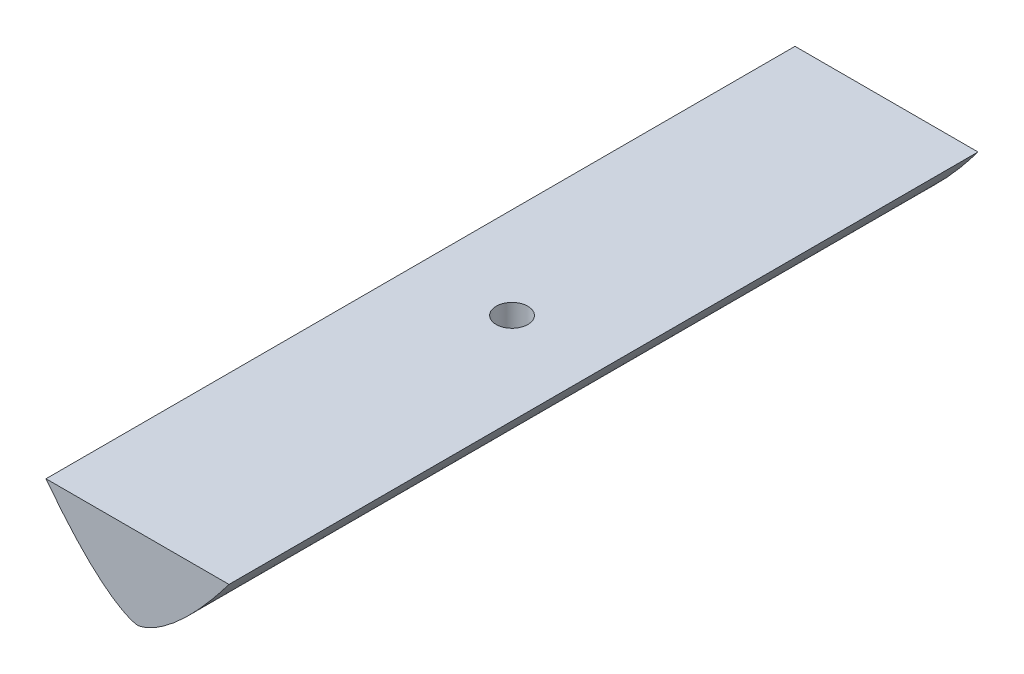
ISO-10303-21;
HEADER;
FILE_DESCRIPTION(('STEP AP214'),'2;1');
FILE_NAME('part.step','',(''),(''),'','','');
FILE_SCHEMA(('AUTOMOTIVE_DESIGN { 1 0 10303 214 1 1 1 1 }'));
ENDSEC;
DATA;
#1=APPLICATION_CONTEXT('core data for automotive mechanical design processes');
#2=APPLICATION_PROTOCOL_DEFINITION('international standard','automotive_design',2000,#1);
#3=PRODUCT_CONTEXT('',#1,'mechanical');
#4=PRODUCT('Part','Part','',(#3));
#5=PRODUCT_RELATED_PRODUCT_CATEGORY('part','',(#4));
#6=PRODUCT_DEFINITION_FORMATION('','',#4);
#7=PRODUCT_DEFINITION_CONTEXT('part definition',#1,'design');
#8=PRODUCT_DEFINITION('design','',#6,#7);
#9=PRODUCT_DEFINITION_SHAPE('','',#8);
#10=(LENGTH_UNIT() NAMED_UNIT(*) SI_UNIT(.MILLI.,.METRE.));
#11=(NAMED_UNIT(*) PLANE_ANGLE_UNIT() SI_UNIT($,.RADIAN.));
#12=(NAMED_UNIT(*) SI_UNIT($,.STERADIAN.) SOLID_ANGLE_UNIT());
#13=UNCERTAINTY_MEASURE_WITH_UNIT(LENGTH_MEASURE(1.E-05),#10,'distance_accuracy_value','');
#14=(GEOMETRIC_REPRESENTATION_CONTEXT(3) GLOBAL_UNCERTAINTY_ASSIGNED_CONTEXT((#13)) GLOBAL_UNIT_ASSIGNED_CONTEXT((#10,
#11,#12)) REPRESENTATION_CONTEXT('',''));
#15=CARTESIAN_POINT('',(0.,0.,0.));
#16=DIRECTION('',(0.,0.,1.));
#17=DIRECTION('',(1.,0.,0.));
#18=AXIS2_PLACEMENT_3D('',#15,#16,#17);
#19=CARTESIAN_POINT('',(0.,-92.52,0.));
#20=DIRECTION('',(0.,1.,0.));
#21=DIRECTION('',(0.,0.,1.));
#22=AXIS2_PLACEMENT_3D('',#19,#20,#21);
#23=PLANE('',#22);
#24=CARTESIAN_POINT('',(0.,-92.52,0.));
#25=DIRECTION('',(0.,1.,0.));
#26=DIRECTION('',(0.,0.,1.));
#27=AXIS2_PLACEMENT_3D('',#24,#25,#26);
#28=CIRCLE('',#27,6.35);
#29=CARTESIAN_POINT('',(0.,-92.52,6.35));
#30=VERTEX_POINT('',#29);
#31=EDGE_CURVE('E91',#30,#30,#28,.F.);
#32=ORIENTED_EDGE('',*,*,#31,.T.);
#33=EDGE_LOOP('',(#32));
#34=FACE_BOUND('',#33,.T.);
#35=DIRECTION('',(1.,0.,0.));
#36=VECTOR('',#35,1.);
#37=CARTESIAN_POINT('',(-52.7426338619544,-92.52,-150.));
#38=LINE('',#37,#36);
#39=CARTESIAN_POINT('',(-36.6476947811617,-92.5200000005668,-150.));
#40=VERTEX_POINT('',#39);
#41=CARTESIAN_POINT('',(36.6477010865553,-92.5199999999962,-150.));
#42=VERTEX_POINT('',#41);
#43=EDGE_CURVE('E86',#40,#42,#38,.T.);
#44=ORIENTED_EDGE('',*,*,#43,.F.);
#45=DIRECTION('',(0.,0.,1.));
#46=VECTOR('',#45,1.);
#47=CARTESIAN_POINT('',(-36.647694781587,-92.5200000000014,-150.));
#48=LINE('',#47,#46);
#49=CARTESIAN_POINT('',(-36.6476947811617,-92.5200000005668,150.));
#50=VERTEX_POINT('',#49);
#51=EDGE_CURVE('E77',#50,#40,#48,.F.);
#52=ORIENTED_EDGE('',*,*,#51,.F.);
#53=DIRECTION('',(1.,0.,0.));
#54=VECTOR('',#53,1.);
#55=CARTESIAN_POINT('',(-52.7426338619544,-92.52,150.));
#56=LINE('',#55,#54);
#57=CARTESIAN_POINT('',(36.6477010865553,-92.5199999999962,150.));
#58=VERTEX_POINT('',#57);
#59=EDGE_CURVE('E85',#50,#58,#56,.T.);
#60=ORIENTED_EDGE('',*,*,#59,.T.);
#61=DIRECTION('',(0.,0.,1.));
#62=VECTOR('',#61,1.);
#63=CARTESIAN_POINT('',(36.6477010865525,-92.52,-150.));
#64=LINE('',#63,#62);
#65=EDGE_CURVE('E87',#42,#58,#64,.T.);
#66=ORIENTED_EDGE('',*,*,#65,.F.);
#67=EDGE_LOOP('',(#44,#52,#60,#66));
#68=FACE_BOUND('',#67,.T.);
#69=ADVANCED_FACE('F33',(#34,#68),#23,.T.);
#70=CARTESIAN_POINT('',(1.99214129898486E-11,-124.999999999991,-150.));
#71=CARTESIAN_POINT('',(0.04052417634533,-124.999999999991,-150.));
#72=CARTESIAN_POINT('',(0.132680738283907,-124.99443985728,-150.));
#73=CARTESIAN_POINT('',(0.341916523726012,-124.973583458145,-150.));
#74=CARTESIAN_POINT('',(0.719215848390711,-124.91674855859,-150.));
#75=CARTESIAN_POINT('',(1.28935930871222,-124.795671244914,-150.));
#76=CARTESIAN_POINT('',(2.1112509865546,-124.564993975685,-150.));
#77=CARTESIAN_POINT('',(3.18818849420226,-124.185399035379,-150.));
#78=CARTESIAN_POINT('',(4.55335692038526,-123.602067095226,-150.));
#79=CARTESIAN_POINT('',(6.24002426541317,-122.749483932227,-150.));
#80=CARTESIAN_POINT('',(8.30348536666619,-121.537471111829,-150.));
#81=CARTESIAN_POINT('',(10.7243382527977,-119.906336413897,-150.));
#82=CARTESIAN_POINT('',(13.7092244855474,-117.633146505461,-150.));
#83=CARTESIAN_POINT('',(17.1252704538273,-114.699994739705,-150.));
#84=CARTESIAN_POINT('',(20.824901988488,-111.164506708708,-150.));
#85=CARTESIAN_POINT('',(25.6391672478892,-106.109725012407,-150.));
#86=CARTESIAN_POINT('',(30.2221890811447,-100.781084361829,-150.));
#87=CARTESIAN_POINT('',(34.5982081132701,-95.2835059363638,-150.));
#88=CARTESIAN_POINT('',(38.7796921951659,-89.6846419299041,-150.));
#89=CARTESIAN_POINT('',(42.0337209653883,-85.1391537234017,-150.));
#90=CARTESIAN_POINT('',(45.9985706416375,-79.3851400766188,-150.));
#91=CARTESIAN_POINT('',(50.6076658418213,-72.3798694722059,-150.));
#92=CARTESIAN_POINT('',(55.055097052488,-65.270591125802,-150.));
#93=CARTESIAN_POINT('',(59.3647173178988,-58.0777276161543,-150.));
#94=CARTESIAN_POINT('',(62.8735066015738,-52.0349417086849,-150.));
#95=CARTESIAN_POINT('',(65.634088968463,-47.1744500309476,-150.));
#96=CARTESIAN_POINT('',(68.3515562987782,-42.2889644712454,-150.));
#97=CARTESIAN_POINT('',(71.0277192556287,-37.3820919874342,-150.));
#98=CARTESIAN_POINT('',(73.6663047604021,-32.452622561229,-150.));
#99=CARTESIAN_POINT('',(76.2670434158788,-27.5070381241099,-150.));
#100=CARTESIAN_POINT('',(78.5150328576176,-23.1588395824158,-150.));
#101=CARTESIAN_POINT('',(80.4175372929979,-19.4295342924188,-150.));
#102=CARTESIAN_POINT('',(81.9960888607339,-16.3021347604907,-150.));
#103=CARTESIAN_POINT('',(83.240093312196,-13.8196133785879,-150.));
#104=CARTESIAN_POINT('',(84.4992613941908,-11.2861580881193,-150.));
#105=CARTESIAN_POINT('',(85.7104943097678,-8.83370724481799,-150.));
#106=CARTESIAN_POINT('',(86.9855106959538,-6.22997447285261,-150.));
#107=CARTESIAN_POINT('',(88.1249163210447,-3.89080690589355,-150.));
#108=CARTESIAN_POINT('',(89.1658132896917,-1.73506722129004,-150.));
#109=CARTESIAN_POINT('',(89.7250298990975,-0.57285437685675,-150.));
#110=CARTESIAN_POINT('',(89.9999999999832,-1.11765701056352E-11,-150.));
#111=B_SPLINE_CURVE_WITH_KNOTS('',4,(#70,#71,#72,#73,#74,#75,#76,#77,#78,#79,#80,#81,#82,#83,
#84,#85,#86,#87,#88,#89,#90,#91,#92,#93,#94,#95,#96,#97,#98,#99,#100,#101,#102,#103,#104,#105,
#106,#107,#108,#109,#110),.UNSPECIFIED.,.F.,.F.,(5,1,1,1,1,1,1,1,1,1,1,1,1,1,1,1,1,1,1,1,1,1,1,
1,1,1,1,1,1,1,1,1,1,1,1,1,1,5),(0.,0.00103393706164033,0.00206787412328066,0.00483210811938311,
0.00888853236437909,0.0145219388316572,0.0218771335459272,0.0312978599904631,0.0433163034992764,
0.0583393941879713,0.0773686452817039,0.0989852332180189,0.130325067263289,0.162749733599858,
0.196051036585961,0.260900538334195,0.293325323762978,0.325750109191762,0.358174889345657,
0.390599669499551,0.455449159051982,0.520298707054147,0.552723498859379,0.585148290664611,
0.617573035285626,0.649997779906641,0.682422553117547,0.714847326328452,0.747272094857862,
0.779696863387272,0.795909247738012,0.812121632088752,0.828334016439492,0.844546400790232,
0.860758800534671,0.876971200279109,0.893183600023547,0.909395999767985),.UNSPECIFIED.);
#112=DIRECTION('',(0.,0.,1.));
#113=VECTOR('',#112,1.);
#114=SURFACE_OF_LINEAR_EXTRUSION('',#111,#113);
#115=CARTESIAN_POINT('',(1.99214129898486E-11,-124.999999999991,-150.));
#116=VERTEX_POINT('',#115);
#117=EDGE_CURVE('E97',#116,#42,#111,.T.);
#118=ORIENTED_EDGE('',*,*,#117,.T.);
#119=ORIENTED_EDGE('',*,*,#65,.T.);
#120=CARTESIAN_POINT('',(1.99214129898486E-11,-124.999999999991,150.));
#121=CARTESIAN_POINT('',(0.04052417634533,-124.999999999991,150.));
#122=CARTESIAN_POINT('',(0.132680738283907,-124.99443985728,150.));
#123=CARTESIAN_POINT('',(0.341916523726012,-124.973583458145,150.));
#124=CARTESIAN_POINT('',(0.719215848390711,-124.91674855859,150.));
#125=CARTESIAN_POINT('',(1.28935930871222,-124.795671244914,150.));
#126=CARTESIAN_POINT('',(2.1112509865546,-124.564993975685,150.));
#127=CARTESIAN_POINT('',(3.18818849420226,-124.185399035379,150.));
#128=CARTESIAN_POINT('',(4.55335692038526,-123.602067095226,150.));
#129=CARTESIAN_POINT('',(6.24002426541317,-122.749483932227,150.));
#130=CARTESIAN_POINT('',(8.30348536666619,-121.537471111829,150.));
#131=CARTESIAN_POINT('',(10.7243382527977,-119.906336413897,150.));
#132=CARTESIAN_POINT('',(13.7092244855474,-117.633146505461,150.));
#133=CARTESIAN_POINT('',(17.1252704538273,-114.699994739705,150.));
#134=CARTESIAN_POINT('',(20.824901988488,-111.164506708708,150.));
#135=CARTESIAN_POINT('',(25.6391672478892,-106.109725012407,150.));
#136=CARTESIAN_POINT('',(30.2221890811447,-100.781084361829,150.));
#137=CARTESIAN_POINT('',(34.5982081132701,-95.2835059363638,150.));
#138=CARTESIAN_POINT('',(38.7796921951659,-89.6846419299041,150.));
#139=CARTESIAN_POINT('',(42.0337209653883,-85.1391537234017,150.));
#140=CARTESIAN_POINT('',(45.9985706416375,-79.3851400766188,150.));
#141=CARTESIAN_POINT('',(50.6076658418213,-72.3798694722059,150.));
#142=CARTESIAN_POINT('',(55.055097052488,-65.270591125802,150.));
#143=CARTESIAN_POINT('',(59.3647173178988,-58.0777276161543,150.));
#144=CARTESIAN_POINT('',(62.8735066015738,-52.0349417086849,150.));
#145=CARTESIAN_POINT('',(65.634088968463,-47.1744500309476,150.));
#146=CARTESIAN_POINT('',(68.3515562987782,-42.2889644712454,150.));
#147=CARTESIAN_POINT('',(71.0277192556287,-37.3820919874342,150.));
#148=CARTESIAN_POINT('',(73.6663047604021,-32.452622561229,150.));
#149=CARTESIAN_POINT('',(76.2670434158788,-27.5070381241099,150.));
#150=CARTESIAN_POINT('',(78.5150328576176,-23.1588395824158,150.));
#151=CARTESIAN_POINT('',(80.4175372929979,-19.4295342924188,150.));
#152=CARTESIAN_POINT('',(81.9960888607339,-16.3021347604907,150.));
#153=CARTESIAN_POINT('',(83.240093312196,-13.8196133785879,150.));
#154=CARTESIAN_POINT('',(84.4992613941908,-11.2861580881193,150.));
#155=CARTESIAN_POINT('',(85.7104943097678,-8.83370724481799,150.));
#156=CARTESIAN_POINT('',(86.9855106959538,-6.22997447285261,150.));
#157=CARTESIAN_POINT('',(88.1249163210447,-3.89080690589355,150.));
#158=CARTESIAN_POINT('',(89.1658132896917,-1.73506722129004,150.));
#159=CARTESIAN_POINT('',(89.7250298990975,-0.57285437685675,150.));
#160=CARTESIAN_POINT('',(89.9999999999832,-1.11765701056352E-11,150.));
#161=B_SPLINE_CURVE_WITH_KNOTS('',4,(#120,#121,#122,#123,#124,#125,#126,#127,#128,#129,#130,
#131,#132,#133,#134,#135,#136,#137,#138,#139,#140,#141,#142,#143,#144,#145,#146,#147,#148,#149,
#150,#151,#152,#153,#154,#155,#156,#157,#158,#159,#160),.UNSPECIFIED.,.F.,.F.,(5,1,1,1,1,1,1,1,
1,1,1,1,1,1,1,1,1,1,1,1,1,1,1,1,1,1,1,1,1,1,1,1,1,1,1,1,1,5),(0.,0.00103393706164033,
0.00206787412328066,0.00483210811938311,0.00888853236437909,0.0145219388316572,
0.0218771335459272,0.0312978599904631,0.0433163034992764,0.0583393941879713,0.0773686452817039,
0.0989852332180189,0.130325067263289,0.162749733599858,0.196051036585961,0.260900538334195,
0.293325323762978,0.325750109191762,0.358174889345657,0.390599669499551,0.455449159051982,
0.520298707054147,0.552723498859379,0.585148290664611,0.617573035285626,0.649997779906641,
0.682422553117547,0.714847326328452,0.747272094857862,0.779696863387272,0.795909247738012,
0.812121632088752,0.828334016439492,0.844546400790232,0.860758800534671,0.876971200279109,
0.893183600023547,0.909395999767985),.UNSPECIFIED.);
#162=CARTESIAN_POINT('',(1.99214129898486E-11,-124.999999999991,150.));
#163=VERTEX_POINT('',#162);
#164=EDGE_CURVE('E37',#163,#58,#161,.T.);
#165=ORIENTED_EDGE('',*,*,#164,.F.);
#166=DIRECTION('',(0.,0.,1.));
#167=VECTOR('',#166,1.);
#168=CARTESIAN_POINT('',(1.99214129898486E-11,-124.999999999991,-150.));
#169=LINE('',#168,#167);
#170=CARTESIAN_POINT('',(1.99214129898486E-11,-124.999999999991,6.35));
#171=VERTEX_POINT('',#170);
#172=EDGE_CURVE('E80',#171,#163,#169,.T.);
#173=ORIENTED_EDGE('',*,*,#172,.F.);
#174=CARTESIAN_POINT('',(1.99214129898486E-11,-124.999999999991,-6.35));
#175=CARTESIAN_POINT('',(0.0158758489435918,-124.999953806764,-6.35000000910518));
#176=CARTESIAN_POINT('',(0.0317415750898974,-124.999531468705,-6.34994046369097));
#177=CARTESIAN_POINT('',(0.0634449085978923,-124.998163361983,-6.34970282001917));
#178=CARTESIAN_POINT('',(0.0792825242155484,-124.997217787819,-6.34952476580856));
#179=CARTESIAN_POINT('',(0.110925259724985,-124.995032267347,-6.3490507843177));
#180=CARTESIAN_POINT('',(0.126730392304805,-124.993792475717,-6.34875491891803));
#181=CARTESIAN_POINT('',(0.158321101336699,-124.991093657372,-6.34804568777102));
#182=CARTESIAN_POINT('',(0.174106675451045,-124.989634606601,-6.34763230912613));
#183=CARTESIAN_POINT('',(0.221363967922017,-124.984995056407,-6.34621856143673));
#184=CARTESIAN_POINT('',(0.252804322196805,-124.981547036549,-6.34504355650109));
#185=CARTESIAN_POINT('',(0.315603320571332,-124.97410266145,-6.34223009674638));
#186=CARTESIAN_POINT('',(0.346961950351738,-124.970106215939,-6.34059156558466));
#187=CARTESIAN_POINT('',(0.409573503333583,-124.961633812017,-6.33685510586798));
#188=CARTESIAN_POINT('',(0.440826465395049,-124.957158055676,-6.33475737051951));
#189=CARTESIAN_POINT('',(0.503228451758402,-124.947760953828,-6.33010584680319));
#190=CARTESIAN_POINT('',(0.534377483221093,-124.942839639707,-6.32755209054491));
#191=CARTESIAN_POINT('',(0.62749246777492,-124.927494505255,-6.31922702380715));
#192=CARTESIAN_POINT('',(0.689300187938519,-124.916465540775,-6.31278149782012));
#193=CARTESIAN_POINT('',(0.812473549679532,-124.893045498029,-6.29811361877499));
#194=CARTESIAN_POINT('',(0.873838962983118,-124.880653763544,-6.2898904078459));
#195=CARTESIAN_POINT('',(0.996076651492868,-124.854693105067,-6.27169450791727));
#196=CARTESIAN_POINT('',(1.05694875378011,-124.84112378629,-6.26172123105352));
#197=CARTESIAN_POINT('',(1.28771458685055,-124.787536622839,-6.22046322736508));
#198=CARTESIAN_POINT('',(1.45578797263739,-124.744045682208,-6.18324188964615));
#199=CARTESIAN_POINT('',(1.78691202667315,-124.651446396003,-6.09580109934192));
#200=CARTESIAN_POINT('',(1.94996124879104,-124.602336451902,-6.04557794276979));
#201=CARTESIAN_POINT('',(2.27092852406256,-124.499950519133,-5.93248908864277));
#202=CARTESIAN_POINT('',(2.42882757529408,-124.446661136026,-5.86958163644278));
#203=CARTESIAN_POINT('',(2.73830273560212,-124.337422021598,-5.73174433733829));
#204=CARTESIAN_POINT('',(2.88987922791208,-124.281472451961,-5.65681522044903));
#205=CARTESIAN_POINT('',(3.19068317743905,-124.166333119769,-5.4929286032637));
#206=CARTESIAN_POINT('',(3.33969727447432,-124.107096589204,-5.40361236124013));
#207=CARTESIAN_POINT('',(3.62983499880349,-123.988157436309,-5.21314891020947));
#208=CARTESIAN_POINT('',(3.77095618015722,-123.92845467596,-5.11199806346642));
#209=CARTESIAN_POINT('',(4.0444952789038,-123.809708723168,-4.8984324224721));
#210=CARTESIAN_POINT('',(4.17692017900275,-123.750665033944,-4.78602685297688));
#211=CARTESIAN_POINT('',(4.43250879329604,-123.634208237396,-4.55033929083393));
#212=CARTESIAN_POINT('',(4.55567169296898,-123.576795273759,-4.42705634367191));
#213=CARTESIAN_POINT('',(4.80195851304622,-123.459866491868,-4.15926841784705));
#214=CARTESIAN_POINT('',(4.92420280791467,-123.400581802333,-4.01385050856301));
#215=CARTESIAN_POINT('',(5.15584222535023,-123.286383844857,-3.71160689766866));
#216=CARTESIAN_POINT('',(5.26524263018218,-123.231468782849,-3.55478592903202));
#217=CARTESIAN_POINT('',(5.47018032669451,-123.127202679748,-3.23054338770772));
#218=CARTESIAN_POINT('',(5.5657161672902,-123.077852221175,-3.06312070806027));
#219=CARTESIAN_POINT('',(5.74178075587892,-122.985918579403,-2.7187918938102));
#220=CARTESIAN_POINT('',(5.82231142913085,-122.943334528134,-2.54188697959465));
#221=CARTESIAN_POINT('',(5.9614302040139,-122.869158993366,-2.19453354811875));
#222=CARTESIAN_POINT('',(6.02126367589212,-122.836958170861,-2.02471377303762));
#223=CARTESIAN_POINT('',(6.12654170616249,-122.779979530115,-1.67944934438994));
#224=CARTESIAN_POINT('',(6.17198691943753,-122.755201374033,-1.50400494722896));
#225=CARTESIAN_POINT('',(6.2477961539365,-122.713714982313,-1.14910425410076));
#226=CARTESIAN_POINT('',(6.27817311260608,-122.69699982421,-0.969651538479348));
#227=CARTESIAN_POINT('',(6.32342641258143,-122.67205471641,-0.608223427743747));
#228=CARTESIAN_POINT('',(6.33830441937106,-122.66382385501,-0.426248305811814));
#229=CARTESIAN_POINT('',(6.35151594612044,-122.65651506251,-0.0825733318741807));
#230=CARTESIAN_POINT('',(6.3515601492505,-122.656490726099,0.0790435865805353));
#231=CARTESIAN_POINT('',(6.33933879054533,-122.663251517806,0.401668489572053));
#232=CARTESIAN_POINT('',(6.3270735706003,-122.670036456798,0.562676490896658));
#233=CARTESIAN_POINT('',(6.29039217443864,-122.690269270972,0.882853921240853));
#234=CARTESIAN_POINT('',(6.26597742885392,-122.703716361671,1.04202356447353));
#235=CARTESIAN_POINT('',(6.20529881953052,-122.736991293196,1.35740735482973));
#236=CARTESIAN_POINT('',(6.16903473944162,-122.756819250528,1.51362144793445));
#237=CARTESIAN_POINT('',(6.08604892943152,-122.801929028771,1.81848564793571));
#238=CARTESIAN_POINT('',(6.03958765313567,-122.827074531244,1.96722711186841));
#239=CARTESIAN_POINT('',(5.93621881592263,-122.882622511598,2.26007219374134));
#240=CARTESIAN_POINT('',(5.87930787009073,-122.913026692714,2.40417429104361));
#241=CARTESIAN_POINT('',(5.755589714293,-122.97855635442,2.68691186039112));
#242=CARTESIAN_POINT('',(5.68878435828855,-123.01368095041,2.82554835040382));
#243=CARTESIAN_POINT('',(5.54579994285805,-123.088100391244,3.09679203050607));
#244=CARTESIAN_POINT('',(5.46961727151985,-123.127396842178,3.22939687024906));
#245=CARTESIAN_POINT('',(5.30179372734249,-123.212950138564,3.49866841263992));
#246=CARTESIAN_POINT('',(5.2093959100242,-123.259513781599,3.6347666811127));
#247=CARTESIAN_POINT('',(5.01497048566629,-123.356048000819,3.89864767229904));
#248=CARTESIAN_POINT('',(4.91293953828677,-123.406019757104,4.02642748440161));
#249=CARTESIAN_POINT('',(4.59338660538796,-123.559870832892,4.39653366028793));
#250=CARTESIAN_POINT('',(4.36234111104986,-123.667718923328,4.62572774892038));
#251=CARTESIAN_POINT('',(3.84063220856209,-123.900159388967,5.06976745661165));
#252=CARTESIAN_POINT('',(3.54616571701379,-124.025247764831,5.2799045566318));
#253=CARTESIAN_POINT('',(3.08013274094588,-124.209333393439,5.55589566404332));
#254=CARTESIAN_POINT('',(2.92060473304433,-124.270148165411,5.64140607469278));
#255=CARTESIAN_POINT('',(2.59403746006515,-124.389233250336,5.79881776493737));
#256=CARTESIAN_POINT('',(2.42700030612385,-124.447504269477,5.87072284031556));
#257=CARTESIAN_POINT('',(2.13074075817549,-124.545236973254,5.98335909705602));
#258=CARTESIAN_POINT('',(2.00304403901126,-124.585634512098,6.02732627655312));
#259=CARTESIAN_POINT('',(1.7442109638707,-124.663432898619,6.10725570804469));
#260=CARTESIAN_POINT('',(1.61307359241302,-124.700832848071,6.14321556634549));
#261=CARTESIAN_POINT('',(1.34823075051547,-124.771601770346,6.206710619041));
#262=CARTESIAN_POINT('',(1.21453605069786,-124.804984583107,6.23427527063838));
#263=CARTESIAN_POINT('',(0.94454673884988,-124.866623205047,6.28085003954895));
#264=CARTESIAN_POINT('',(0.808253905023355,-124.894882390874,6.29986580319374));
#265=CARTESIAN_POINT('',(0.615647044919259,-124.929470477741,6.32032944351943));
#266=CARTESIAN_POINT('',(0.560246763346033,-124.938807775431,6.32548266576699));
#267=CARTESIAN_POINT('',(0.476910645909013,-124.951782125431,6.33212699065322));
#268=CARTESIAN_POINT('',(0.449098201016947,-124.955934254208,6.33416055156186));
#269=CARTESIAN_POINT('',(0.393393804602601,-124.963868225305,6.33786403887069));
#270=CARTESIAN_POINT('',(0.365501846532845,-124.967650036167,6.33953393439419));
#271=CARTESIAN_POINT('',(0.309596459470709,-124.974823600202,6.34251015478802));
#272=CARTESIAN_POINT('',(0.281582901683522,-124.978214628759,6.34381581042913));
#273=CARTESIAN_POINT('',(0.225491344322546,-124.984522534148,6.34605714833157));
#274=CARTESIAN_POINT('',(0.197413356028282,-124.987439488378,6.34699289102068));
#275=CARTESIAN_POINT('',(0.155232746267379,-124.991360327096,6.34811790127948));
#276=CARTESIAN_POINT('',(0.141154916909645,-124.992592007493,6.34844656483217));
#277=CARTESIAN_POINT('',(0.11298331841407,-124.994863199308,6.34901041510558));
#278=CARTESIAN_POINT('',(0.0988895510357089,-124.995902730183,6.34924561129373));
#279=CARTESIAN_POINT('',(0.0706753728393836,-124.9977229043,6.34962235945986));
#280=CARTESIAN_POINT('',(0.0565549521858567,-124.998503417063,6.34976386427709));
#281=CARTESIAN_POINT('',(0.0282921410114457,-124.999625808685,6.34995270621669));
#282=CARTESIAN_POINT('',(0.014149744620166,-124.999967537145,6.3500000110537));
#283=CARTESIAN_POINT('',(1.99214129898486E-11,-124.999999999991,6.35000000000011));
#284=B_SPLINE_CURVE_WITH_KNOTS('',3,(#174,#175,#176,#177,#178,#179,#180,#181,#182,#183,#184,
#185,#186,#187,#188,#189,#190,#191,#192,#193,#194,#195,#196,#197,#198,#199,#200,#201,#202,#203,
#204,#205,#206,#207,#208,#209,#210,#211,#212,#213,#214,#215,#216,#217,#218,#219,#220,#221,#222,
#223,#224,#225,#226,#227,#228,#229,#230,#231,#232,#233,#234,#235,#236,#237,#238,#239,#240,#241,
#242,#243,#244,#245,#246,#247,#248,#249,#250,#251,#252,#253,#254,#255,#256,#257,#258,#259,#260,
#261,#262,#263,#264,#265,#266,#267,#268,#269,#270,#271,#272,#273,#274,#275,#276,#277,#278,#279,
#280,#281,#282,#283),.UNSPECIFIED.,.F.,.F.,(4,2,2,2,2,2,2,2,2,2,2,2,2,2,2,2,2,2,2,2,2,2,2,2,2,2,
2,2,2,2,2,2,2,2,2,2,2,2,2,2,2,2,2,2,2,2,2,2,2,2,2,2,2,2,4),(0.,0.0476104772131877,
0.095203268583415,0.142771094648109,0.190344143492789,0.285285519549418,0.380242541538394,
0.475159687647892,0.570070153037644,0.759363977004765,0.948749354673393,1.13819847094405,
1.67008429770328,2.20212181633345,2.73594018043563,3.2697261406932,3.81982525815281,
4.37009391222916,4.91991518300444,5.46978474990673,6.06603695453086,6.66204307500834,
7.25811152940257,7.85410345165928,8.40206140320634,8.94999441081149,9.49745615104404,
10.0448590561516,10.52910911014,11.0133457146139,11.4975253127088,11.9817137516562,
12.4547361544741,12.9279120525041,13.4009994012828,13.8742695453051,14.3866109250374,
14.8991306190036,15.9238027319779,17.0667294928245,17.639047620699,18.2112058400551,
18.6338387601226,19.0565978521804,19.4778560030145,19.8988355128977,20.0680580755593,
20.1526357905024,20.237220683645,20.3219599787624,20.4066854254209,20.4490903745822,
20.4914910274034,20.5339130069446,20.5763495233619),.UNSPECIFIED.);
#285=CARTESIAN_POINT('',(1.99214129898486E-11,-124.999999999991,-6.34999999999999));
#286=VERTEX_POINT('',#285);
#287=EDGE_CURVE('E50',#286,#171,#284,.T.);
#288=ORIENTED_EDGE('',*,*,#287,.F.);
#289=EDGE_CURVE('E126',#116,#286,#169,.T.);
#290=ORIENTED_EDGE('',*,*,#289,.F.);
#291=EDGE_LOOP('',(#118,#119,#165,#173,#288,#290));
#292=FACE_BOUND('',#291,.T.);
#293=ADVANCED_FACE('F111',(#292),#114,.T.);
#294=CARTESIAN_POINT('',(-90.000000000001,2.02389109575604E-12,-150.));
#295=CARTESIAN_POINT('',(-89.7287799215119,-0.565041830183454,-150.));
#296=CARTESIAN_POINT('',(-89.1769696999906,-1.7119011396164,-150.));
#297=CARTESIAN_POINT('',(-88.1522968285625,-3.83418853962012,-150.));
#298=CARTESIAN_POINT('',(-87.0256216323926,-6.14778150957435,-150.));
#299=CARTESIAN_POINT('',(-85.7702408599494,-8.71205451363004,-150.));
#300=CARTESIAN_POINT('',(-84.5750109306655,-11.1331330972931,-150.));
#301=CARTESIAN_POINT('',(-83.3334861961047,-13.6323373136231,-150.));
#302=CARTESIAN_POINT('',(-82.1079807270131,-16.0793853852928,-150.));
#303=CARTESIAN_POINT('',(-80.8613078480234,-18.5512681634737,-150.));
#304=CARTESIAN_POINT('',(-79.6147241148221,-21.0031983730774,-150.));
#305=CARTESIAN_POINT('',(-78.0419469470306,-24.073051937383,-150.));
#306=CARTESIAN_POINT('',(-76.1411202296189,-27.7433014503863,-150.));
#307=CARTESIAN_POINT('',(-73.8976202164458,-32.0158335495403,-150.));
#308=CARTESIAN_POINT('',(-71.2993743897047,-36.8781590882088,-150.));
#309=CARTESIAN_POINT('',(-68.6634579703094,-41.7214329736065,-150.));
#310=CARTESIAN_POINT('',(-65.3196001268725,-47.7478310919678,-150.));
#311=CARTESIAN_POINT('',(-61.9057750936895,-53.7354515988975,-150.));
#312=CARTESIAN_POINT('',(-58.4153924458366,-59.6785805494722,-150.));
#313=CARTESIAN_POINT('',(-54.1245222469686,-66.7491790365763,-150.));
#314=CARTESIAN_POINT('',(-50.4569081107591,-72.584773085158,-150.));
#315=CARTESIAN_POINT('',(-46.6861989824506,-78.3546086656338,-150.));
#316=CARTESIAN_POINT('',(-42.0196546172396,-85.183243954868,-150.));
#317=CARTESIAN_POINT('',(-37.1971625918209,-91.9035094496485,-150.));
#318=CARTESIAN_POINT('',(-31.9659496817484,-98.6943750875519,-150.));
#319=CARTESIAN_POINT('',(-26.4240119309792,-105.235278479561,-150.));
#320=CARTESIAN_POINT('',(-21.5050773033514,-110.483804705851,-150.));
#321=CARTESIAN_POINT('',(-17.6257924713411,-114.241326427069,-150.));
#322=CARTESIAN_POINT('',(-14.1803245350885,-117.248508249794,-150.));
#323=CARTESIAN_POINT('',(-11.1234549797758,-119.618653213116,-150.));
#324=CARTESIAN_POINT('',(-8.63557314303448,-121.326761696326,-150.));
#325=CARTESIAN_POINT('',(-6.50865865296434,-122.601737804343,-150.));
#326=CARTESIAN_POINT('',(-4.76818473699802,-123.501182230943,-150.));
#327=CARTESIAN_POINT('',(-3.3618837973863,-124.11729408906,-150.));
#328=CARTESIAN_POINT('',(-2.23928333382458,-124.524207656603,-150.));
#329=CARTESIAN_POINT('',(-1.38198372297948,-124.772747972149,-150.));
#330=CARTESIAN_POINT('',(-0.75617299970219,-124.911034050922,-150.));
#331=CARTESIAN_POINT('',(-0.347330621147917,-124.973877643986,-150.));
#332=CARTESIAN_POINT('',(-0.123395647498381,-124.995337069226,-150.));
#333=CARTESIAN_POINT('',(-0.0205041113270957,-124.999999999991,-150.));
#334=CARTESIAN_POINT('',(1.99373958062784E-11,-124.999999999991,-150.));
#335=B_SPLINE_CURVE_WITH_KNOTS('',4,(#294,#295,#296,#297,#298,#299,#300,#301,#302,#303,#304,
#305,#306,#307,#308,#309,#310,#311,#312,#313,#314,#315,#316,#317,#318,#319,#320,#321,#322,#323,
#324,#325,#326,#327,#328,#329,#330,#331,#332,#333,#334),.UNSPECIFIED.,.F.,.F.,(5,1,1,1,1,1,1,1,
1,1,1,1,1,1,1,1,1,1,1,1,1,1,1,1,1,1,1,1,1,1,1,1,1,1,1,1,1,5),(0.0906040002037184,
0.106595296404402,0.122586592605086,0.138577888805769,0.154569185006453,0.170560469837402,
0.186551754668351,0.2025430394993,0.218534324330249,0.234525597989239,0.250516871648229,
0.282499418966208,0.314481991055738,0.346464563145268,0.378447154569264,0.410429745993261,
0.474394816871329,0.50637741432234,0.538360011773351,0.602325099359595,0.634307686149558,
0.666290272939521,0.730255400632888,0.794220554496453,0.833134058899479,0.865116624781684,
0.897099301206955,0.919478735971019,0.939186071609823,0.954818475650913,0.967077107134405,
0.976978528047083,0.984613115136046,0.990416571643528,0.994763933757022,0.997672430907831,
0.999476856470563,1.),.UNSPECIFIED.);
#336=DIRECTION('',(0.,0.,1.));
#337=VECTOR('',#336,1.);
#338=SURFACE_OF_LINEAR_EXTRUSION('',#335,#337);
#339=CARTESIAN_POINT('',(-90.000000000001,2.02389109575604E-12,150.));
#340=CARTESIAN_POINT('',(-89.7287799215119,-0.565041830183454,150.));
#341=CARTESIAN_POINT('',(-89.1769696999906,-1.7119011396164,150.));
#342=CARTESIAN_POINT('',(-88.1522968285625,-3.83418853962012,150.));
#343=CARTESIAN_POINT('',(-87.0256216323926,-6.14778150957435,150.));
#344=CARTESIAN_POINT('',(-85.7702408599494,-8.71205451363004,150.));
#345=CARTESIAN_POINT('',(-84.5750109306655,-11.1331330972931,150.));
#346=CARTESIAN_POINT('',(-83.3334861961047,-13.6323373136231,150.));
#347=CARTESIAN_POINT('',(-82.1079807270131,-16.0793853852928,150.));
#348=CARTESIAN_POINT('',(-80.8613078480234,-18.5512681634737,150.));
#349=CARTESIAN_POINT('',(-79.6147241148221,-21.0031983730774,150.));
#350=CARTESIAN_POINT('',(-78.0419469470306,-24.073051937383,150.));
#351=CARTESIAN_POINT('',(-76.1411202296189,-27.7433014503863,150.));
#352=CARTESIAN_POINT('',(-73.8976202164458,-32.0158335495403,150.));
#353=CARTESIAN_POINT('',(-71.2993743897047,-36.8781590882088,150.));
#354=CARTESIAN_POINT('',(-68.6634579703094,-41.7214329736065,150.));
#355=CARTESIAN_POINT('',(-65.3196001268725,-47.7478310919678,150.));
#356=CARTESIAN_POINT('',(-61.9057750936895,-53.7354515988975,150.));
#357=CARTESIAN_POINT('',(-58.4153924458366,-59.6785805494722,150.));
#358=CARTESIAN_POINT('',(-54.1245222469686,-66.7491790365763,150.));
#359=CARTESIAN_POINT('',(-50.4569081107591,-72.584773085158,150.));
#360=CARTESIAN_POINT('',(-46.6861989824506,-78.3546086656338,150.));
#361=CARTESIAN_POINT('',(-42.0196546172396,-85.183243954868,150.));
#362=CARTESIAN_POINT('',(-37.1971625918209,-91.9035094496485,150.));
#363=CARTESIAN_POINT('',(-31.9659496817484,-98.6943750875519,150.));
#364=CARTESIAN_POINT('',(-26.4240119309792,-105.235278479561,150.));
#365=CARTESIAN_POINT('',(-21.5050773033514,-110.483804705851,150.));
#366=CARTESIAN_POINT('',(-17.6257924713411,-114.241326427069,150.));
#367=CARTESIAN_POINT('',(-14.1803245350885,-117.248508249794,150.));
#368=CARTESIAN_POINT('',(-11.1234549797758,-119.618653213116,150.));
#369=CARTESIAN_POINT('',(-8.63557314303448,-121.326761696326,150.));
#370=CARTESIAN_POINT('',(-6.50865865296434,-122.601737804343,150.));
#371=CARTESIAN_POINT('',(-4.76818473699802,-123.501182230943,150.));
#372=CARTESIAN_POINT('',(-3.3618837973863,-124.11729408906,150.));
#373=CARTESIAN_POINT('',(-2.23928333382458,-124.524207656603,150.));
#374=CARTESIAN_POINT('',(-1.38198372297948,-124.772747972149,150.));
#375=CARTESIAN_POINT('',(-0.75617299970219,-124.911034050922,150.));
#376=CARTESIAN_POINT('',(-0.347330621147917,-124.973877643986,150.));
#377=CARTESIAN_POINT('',(-0.123395647498381,-124.995337069226,150.));
#378=CARTESIAN_POINT('',(-0.0205041113270957,-124.999999999991,150.));
#379=CARTESIAN_POINT('',(1.99373958062784E-11,-124.999999999991,150.));
#380=B_SPLINE_CURVE_WITH_KNOTS('',4,(#339,#340,#341,#342,#343,#344,#345,#346,#347,#348,#349,
#350,#351,#352,#353,#354,#355,#356,#357,#358,#359,#360,#361,#362,#363,#364,#365,#366,#367,#368,
#369,#370,#371,#372,#373,#374,#375,#376,#377,#378,#379),.UNSPECIFIED.,.F.,.F.,(5,1,1,1,1,1,1,1,
1,1,1,1,1,1,1,1,1,1,1,1,1,1,1,1,1,1,1,1,1,1,1,1,1,1,1,1,1,5),(0.0906040002037184,
0.106595296404402,0.122586592605086,0.138577888805769,0.154569185006453,0.170560469837402,
0.186551754668351,0.2025430394993,0.218534324330249,0.234525597989239,0.250516871648229,
0.282499418966208,0.314481991055738,0.346464563145268,0.378447154569264,0.410429745993261,
0.474394816871329,0.50637741432234,0.538360011773351,0.602325099359595,0.634307686149558,
0.666290272939521,0.730255400632888,0.794220554496453,0.833134058899479,0.865116624781684,
0.897099301206955,0.919478735971019,0.939186071609823,0.954818475650913,0.967077107134405,
0.976978528047083,0.984613115136046,0.990416571643528,0.994763933757022,0.997672430907831,
0.999476856470563,1.),.UNSPECIFIED.);
#381=EDGE_CURVE('E44',#50,#163,#380,.T.);
#382=ORIENTED_EDGE('',*,*,#381,.F.);
#383=ORIENTED_EDGE('',*,*,#51,.T.);
#384=EDGE_CURVE('E103',#40,#116,#335,.T.);
#385=ORIENTED_EDGE('',*,*,#384,.T.);
#386=ORIENTED_EDGE('',*,*,#289,.T.);
#387=CARTESIAN_POINT('',(1.99373958062784E-11,-124.999999999991,6.35));
#388=CARTESIAN_POINT('',(-0.00828277786621266,-124.99998033754,6.34999999948818));
#389=CARTESIAN_POINT('',(-0.0165623760797191,-124.999812220562,6.34998379433379));
#390=CARTESIAN_POINT('',(-0.0331138408636557,-124.999276693426,6.34991905070736));
#391=CARTESIAN_POINT('',(-0.0413857085900011,-124.998909320525,6.34987051827961));
#392=CARTESIAN_POINT('',(-0.0579216691688828,-124.998072906514,6.34974120983976));
#393=CARTESIAN_POINT('',(-0.0661857633052415,-124.997603887148,6.349660440721));
#394=CARTESIAN_POINT('',(-0.0827096281579886,-124.996592890968,6.34946670103197));
#395=CARTESIAN_POINT('',(-0.0909693986029627,-124.996050910022,6.34935372863792));
#396=CARTESIAN_POINT('',(-0.115732617245823,-124.994328058867,6.34896672441836));
#397=CARTESIAN_POINT('',(-0.132228616333887,-124.993049815594,6.34864453783977));
#398=CARTESIAN_POINT('',(-0.165198730733552,-124.99026086202,6.34787218814641));
#399=CARTESIAN_POINT('',(-0.181672844545612,-124.988750136543,6.34742201667514));
#400=CARTESIAN_POINT('',(-0.230988786339695,-124.983920328676,6.34588248998563));
#401=CARTESIAN_POINT('',(-0.263795345408645,-124.980298416324,6.34460300565329));
#402=CARTESIAN_POINT('',(-0.329312776787742,-124.972428847111,6.34153993677405));
#403=CARTESIAN_POINT('',(-0.362023634964272,-124.968181102154,6.33975628122457));
#404=CARTESIAN_POINT('',(-0.42732770522429,-124.959161518294,6.33568944908397));
#405=CARTESIAN_POINT('',(-0.459920961128195,-124.954389901309,6.33340648360306));
#406=CARTESIAN_POINT('',(-0.524992800591176,-124.94436942096,6.32834477291783));
#407=CARTESIAN_POINT('',(-0.557471390665152,-124.939120585178,6.32556605635809));
#408=CARTESIAN_POINT('',(-0.654539595632014,-124.922761209163,6.31650960037323));
#409=CARTESIAN_POINT('',(-0.718954938941517,-124.911010541727,6.30949946731789));
#410=CARTESIAN_POINT('',(-0.847299199350881,-124.886079656079,6.29354968656403));
#411=CARTESIAN_POINT('',(-0.911227854253528,-124.87289871862,6.28460906581455));
#412=CARTESIAN_POINT('',(-1.03853961050692,-124.845296259397,6.26482944093264));
#413=CARTESIAN_POINT('',(-1.10192251850535,-124.830874316366,6.25398979086089));
#414=CARTESIAN_POINT('',(-1.33591490841826,-124.775404940217,6.21031798732227));
#415=CARTESIAN_POINT('',(-1.50466253434241,-124.73097453675,6.17155854167219));
#416=CARTESIAN_POINT('',(-1.83699890066202,-124.636624634697,6.08092279325793));
#417=CARTESIAN_POINT('',(-2.00058631035955,-124.586703734894,6.02904313770481));
#418=CARTESIAN_POINT('',(-2.32247975319904,-124.482793240257,5.91252711468995));
#419=CARTESIAN_POINT('',(-2.48076659378552,-124.42879077263,5.84784924911467));
#420=CARTESIAN_POINT('',(-2.79086781051413,-124.318228996275,5.70636516412774));
#421=CARTESIAN_POINT('',(-2.94268252502601,-124.261669821534,5.62955957975633));
#422=CARTESIAN_POINT('',(-3.24356384243541,-124.14549697496,5.46189568712454));
#423=CARTESIAN_POINT('',(-3.39242388106719,-124.085842273455,5.37069511489956));
#424=CARTESIAN_POINT('',(-3.68209583250446,-123.966199248582,5.17639788864551));
#425=CARTESIAN_POINT('',(-3.82290524039356,-123.906210827682,5.07329756186125));
#426=CARTESIAN_POINT('',(-4.09565020809505,-123.787034283165,4.85577488381869));
#427=CARTESIAN_POINT('',(-4.22759277222701,-123.727845558081,4.74136165000024));
#428=CARTESIAN_POINT('',(-4.48202571317613,-123.611247160871,4.50161113147282));
#429=CARTESIAN_POINT('',(-4.60451528230267,-123.553837641014,4.37627291524649));
#430=CARTESIAN_POINT('',(-4.84845972397277,-123.437427760446,4.10496822953266));
#431=CARTESIAN_POINT('',(-4.96908423354053,-123.378654214084,3.95815508382536));
#432=CARTESIAN_POINT('',(-5.1973663753293,-123.265628774238,3.65323651207161));
#433=CARTESIAN_POINT('',(-5.30502944106625,-123.211374989003,3.49513586240536));
#434=CARTESIAN_POINT('',(-5.50636533412692,-123.108579088923,3.16847749782523));
#435=CARTESIAN_POINT('',(-5.60003740351286,-123.060037283545,2.99991921708707));
#436=CARTESIAN_POINT('',(-5.77225504699463,-122.969855207048,2.65348368943397));
#437=CARTESIAN_POINT('',(-5.85080261165277,-122.928214027827,2.47560767276761));
#438=CARTESIAN_POINT('',(-5.98577768002947,-122.856086333102,2.12717778001015));
#439=CARTESIAN_POINT('',(-6.04350801494346,-122.824957122505,1.95726135770943));
#440=CARTESIAN_POINT('',(-6.14460780916544,-122.770148754052,1.6120288601009));
#441=CARTESIAN_POINT('',(-6.18797797041117,-122.746469232052,1.43671304917789));
#442=CARTESIAN_POINT('',(-6.25969641965231,-122.707177057252,1.0822951487046));
#443=CARTESIAN_POINT('',(-6.28805722574226,-122.691557682405,0.903196344314718));
#444=CARTESIAN_POINT('',(-6.32936635220511,-122.668772158775,0.542702081133863));
#445=CARTESIAN_POINT('',(-6.34231626144371,-122.661605138555,0.361306861052903));
#446=CARTESIAN_POINT('',(-6.35201470145894,-122.656238742672,0.0186771891071566));
#447=CARTESIAN_POINT('',(-6.35044193776947,-122.657110172989,-0.142498105398722));
#448=CARTESIAN_POINT('',(-6.33506384000632,-122.66561553492,-0.464085081179292));
#449=CARTESIAN_POINT('',(-6.3212587993483,-122.673249304325,-0.62449678067755));
#450=CARTESIAN_POINT('',(-6.28159306829031,-122.695115838224,-0.943344028212772));
#451=CARTESIAN_POINT('',(-6.25573366488565,-122.709347898245,-1.1017797853594));
#452=CARTESIAN_POINT('',(-6.19227498092767,-122.744115261995,-1.41557611991183));
#453=CARTESIAN_POINT('',(-6.15467545708869,-122.764650696346,-1.57093663351968));
#454=CARTESIAN_POINT('',(-6.06900124111084,-122.81116274246,-1.87460211791976));
#455=CARTESIAN_POINT('',(-6.02114211170244,-122.837027010903,-2.02298533557797));
#456=CARTESIAN_POINT('',(-5.91501679726012,-122.893961897727,-2.31499927770571));
#457=CARTESIAN_POINT('',(-5.85674723222797,-122.92503420682,-2.45862844065202));
#458=CARTESIAN_POINT('',(-5.73035174520937,-122.991844258807,-2.74032696303882));
#459=CARTESIAN_POINT('',(-5.66222746488971,-123.027581224533,-2.87839724362885));
#460=CARTESIAN_POINT('',(-5.51667104772968,-123.103150519749,-3.14839527510744));
#461=CARTESIAN_POINT('',(-5.43923553841159,-123.142984332335,-3.28032077624208));
#462=CARTESIAN_POINT('',(-5.17990116474875,-123.274803034101,-3.68786166466908));
#463=CARTESIAN_POINT('',(-4.98168082371294,-123.373330126765,-3.95121826778259));
#464=CARTESIAN_POINT('',(-4.54942647769938,-123.580554515667,-4.4421120476691));
#465=CARTESIAN_POINT('',(-4.31537232523269,-123.689257519848,-4.66962892670524));
#466=CARTESIAN_POINT('',(-3.92688111008923,-123.86127821053,-4.99348832725236));
#467=CARTESIAN_POINT('',(-3.78298647880062,-123.923416593888,-5.10335722393529));
#468=CARTESIAN_POINT('',(-3.48634221307284,-124.047612854315,-5.31042500828648));
#469=CARTESIAN_POINT('',(-3.33359513096957,-124.109670749366,-5.40762752192457));
#470=CARTESIAN_POINT('',(-3.01982911937608,-124.23248930838,-5.58891740518384));
#471=CARTESIAN_POINT('',(-2.85880334639256,-124.29324883837,-5.67299368466074));
#472=CARTESIAN_POINT('',(-2.52932756669352,-124.412008936982,-5.82735610443059));
#473=CARTESIAN_POINT('',(-2.36087977586722,-124.470010318456,-5.89764632692668));
#474=CARTESIAN_POINT('',(-2.06381291558425,-124.56652486098,-6.00674556081037));
#475=CARTESIAN_POINT('',(-1.93675514565936,-124.606063383954,-6.04892585981834));
#476=CARTESIAN_POINT('',(-1.67936693812447,-124.682059183124,-6.12537744982307));
#477=CARTESIAN_POINT('',(-1.5490364680711,-124.718516428759,-6.15964866238006));
#478=CARTESIAN_POINT('',(-1.28591034579667,-124.787327099558,-6.21989401196911));
#479=CARTESIAN_POINT('',(-1.1531253895548,-124.819694974964,-6.2458978865863));
#480=CARTESIAN_POINT('',(-0.952080112788553,-124.864258782505,-6.27858689764543));
#481=CARTESIAN_POINT('',(-0.884759747816928,-124.878447639211,-6.28842984343949));
#482=CARTESIAN_POINT('',(-0.749537921233129,-124.905282357053,-6.30597649943062));
#483=CARTESIAN_POINT('',(-0.681636539127668,-124.917928425802,-6.31368049764523));
#484=CARTESIAN_POINT('',(-0.562908056145437,-124.93833249398,-6.32520478755164));
#485=CARTESIAN_POINT('',(-0.512199629596554,-124.946509472774,-6.32951424556612));
#486=CARTESIAN_POINT('',(-0.410532640040709,-124.961673743192,-6.33692034192429));
#487=CARTESIAN_POINT('',(-0.359574178985977,-124.968661483986,-6.34001743874885));
#488=CARTESIAN_POINT('',(-0.282916220279516,-124.978046658966,-6.34374609401734));
#489=CARTESIAN_POINT('',(-0.257305205573829,-124.980994329391,-6.34483667818999));
#490=CARTESIAN_POINT('',(-0.206025526221821,-124.986435877056,-6.34670872152662));
#491=CARTESIAN_POINT('',(-0.180356868529402,-124.988929806338,-6.34749021615485));
#492=CARTESIAN_POINT('',(-0.141801329297603,-124.992256846801,-6.34842955895387));
#493=CARTESIAN_POINT('',(-0.128934946977577,-124.993297258023,-6.34870392736486));
#494=CARTESIAN_POINT('',(-0.103189985309589,-124.995223983172,-6.34917455747793));
#495=CARTESIAN_POINT('',(-0.0903114067396407,-124.996110306339,-6.3493708238647));
#496=CARTESIAN_POINT('',(-0.0645377316956915,-124.997718789359,-6.34968511525833));
#497=CARTESIAN_POINT('',(-0.0516426308053951,-124.998440886722,-6.34980311051492));
#498=CARTESIAN_POINT('',(-0.0322874568966314,-124.999290019337,-6.34992119220878));
#499=CARTESIAN_POINT('',(-0.0258331053829515,-124.999534071915,-6.34995073424796));
#500=CARTESIAN_POINT('',(-0.0129197273221553,-124.999884879387,-6.34999014033734));
#501=CARTESIAN_POINT('',(-0.00646070016797426,-124.999991610997,-6.35000000105063));
#502=CARTESIAN_POINT('',(1.99373958062784E-11,-124.999999999991,-6.34999999999999));
#503=B_SPLINE_CURVE_WITH_KNOTS('',3,(#387,#388,#389,#390,#391,#392,#393,#394,#395,#396,#397,
#398,#399,#400,#401,#402,#403,#404,#405,#406,#407,#408,#409,#410,#411,#412,#413,#414,#415,#416,
#417,#418,#419,#420,#421,#422,#423,#424,#425,#426,#427,#428,#429,#430,#431,#432,#433,#434,#435,
#436,#437,#438,#439,#440,#441,#442,#443,#444,#445,#446,#447,#448,#449,#450,#451,#452,#453,#454,
#455,#456,#457,#458,#459,#460,#461,#462,#463,#464,#465,#466,#467,#468,#469,#470,#471,#472,#473,
#474,#475,#476,#477,#478,#479,#480,#481,#482,#483,#484,#485,#486,#487,#488,#489,#490,#491,#492,
#493,#494,#495,#496,#497,#498,#499,#500,#501,#502),.UNSPECIFIED.,.F.,.F.,(4,2,2,2,2,2,2,2,2,2,2,
2,2,2,2,2,2,2,2,2,2,2,2,2,2,2,2,2,2,2,2,2,2,2,2,2,2,2,2,2,2,2,2,2,2,2,2,2,2,2,2,2,2,2,2,2,2,4),
(0.,0.0248431069295233,0.0496815701949168,0.0745147249601951,0.0993492863885143,
0.14899244412227,0.198638843944791,0.297717743892439,0.396810604104898,0.495861648180869,
0.594906970923935,0.792411320915483,0.990015455173668,1.18768693382457,1.72316237630786,
2.25877479476134,2.79615326442975,3.3335036048298,3.88639952998265,4.43946656026637,
4.99209143370381,5.54476347281652,6.14066531907006,6.73631648332179,7.33199990424001,
7.92760487256254,8.47324718511141,9.01886282225287,9.56402268532756,10.1091263374703,
10.5920863049425,11.0750346879661,11.5579315203598,12.0408383602893,12.5144499415348,
12.9882155725372,13.4619023710709,13.9357612561794,14.9634116249841,15.9916419245703,
16.5653344211572,17.1388623259251,17.7128722030631,18.2867118520912,18.7052205410251,
19.1237333804147,19.5407233369886,19.7491814588531,19.9576114973982,20.1122196172852,
20.2667692121168,20.3441744285112,20.4215707610282,20.4603036547287,20.4990342248138,
20.5377795076772,20.557155387074,20.5765345513197),.UNSPECIFIED.);
#504=EDGE_CURVE('E11',#171,#286,#503,.T.);
#505=ORIENTED_EDGE('',*,*,#504,.F.);
#506=ORIENTED_EDGE('',*,*,#172,.T.);
#507=EDGE_LOOP('',(#382,#383,#385,#386,#505,#506));
#508=FACE_BOUND('',#507,.T.);
#509=ADVANCED_FACE('F76',(#508),#338,.T.);
#510=CARTESIAN_POINT('',(0.,-124.999999999991,0.));
#511=DIRECTION('',(0.,1.,0.));
#512=DIRECTION('',(0.,0.,1.));
#513=AXIS2_PLACEMENT_3D('',#510,#511,#512);
#514=CYLINDRICAL_SURFACE('',#513,6.35);
#515=ORIENTED_EDGE('',*,*,#504,.T.);
#516=ORIENTED_EDGE('',*,*,#287,.T.);
#517=EDGE_LOOP('',(#515,#516));
#518=FACE_BOUND('',#517,.T.);
#519=ORIENTED_EDGE('',*,*,#31,.F.);
#520=EDGE_LOOP('',(#519));
#521=FACE_BOUND('',#520,.T.);
#522=ADVANCED_FACE('F117',(#518,#521),#514,.F.);
#523=CARTESIAN_POINT('',(-52.7426338619544,-68.9224547357826,150.));
#524=DIRECTION('',(0.,0.,-1.));
#525=DIRECTION('',(-1.,0.,0.));
#526=AXIS2_PLACEMENT_3D('',#523,#524,#525);
#527=PLANE('',#526);
#528=ORIENTED_EDGE('',*,*,#59,.F.);
#529=ORIENTED_EDGE('',*,*,#381,.T.);
#530=ORIENTED_EDGE('',*,*,#164,.T.);
#531=EDGE_LOOP('',(#528,#529,#530));
#532=FACE_BOUND('',#531,.T.);
#533=ADVANCED_FACE('F89',(#532),#527,.F.);
#534=CARTESIAN_POINT('',(-52.7426338619544,-68.9224547357826,-150.));
#535=DIRECTION('',(0.,0.,-1.));
#536=DIRECTION('',(-1.,0.,0.));
#537=AXIS2_PLACEMENT_3D('',#534,#535,#536);
#538=PLANE('',#537);
#539=ORIENTED_EDGE('',*,*,#384,.F.);
#540=ORIENTED_EDGE('',*,*,#43,.T.);
#541=ORIENTED_EDGE('',*,*,#117,.F.);
#542=EDGE_LOOP('',(#539,#540,#541));
#543=FACE_BOUND('',#542,.T.);
#544=ADVANCED_FACE('F35',(#543),#538,.T.);
#545=CLOSED_SHELL('',(#69,#293,#509,#522,#533,#544));
#546=MANIFOLD_SOLID_BREP('B2',#545);
#547=ADVANCED_BREP_SHAPE_REPRESENTATION('',(#18,#546),#14);
#548=SHAPE_DEFINITION_REPRESENTATION(#9,#547);
ENDSEC;
END-ISO-10303-21;
